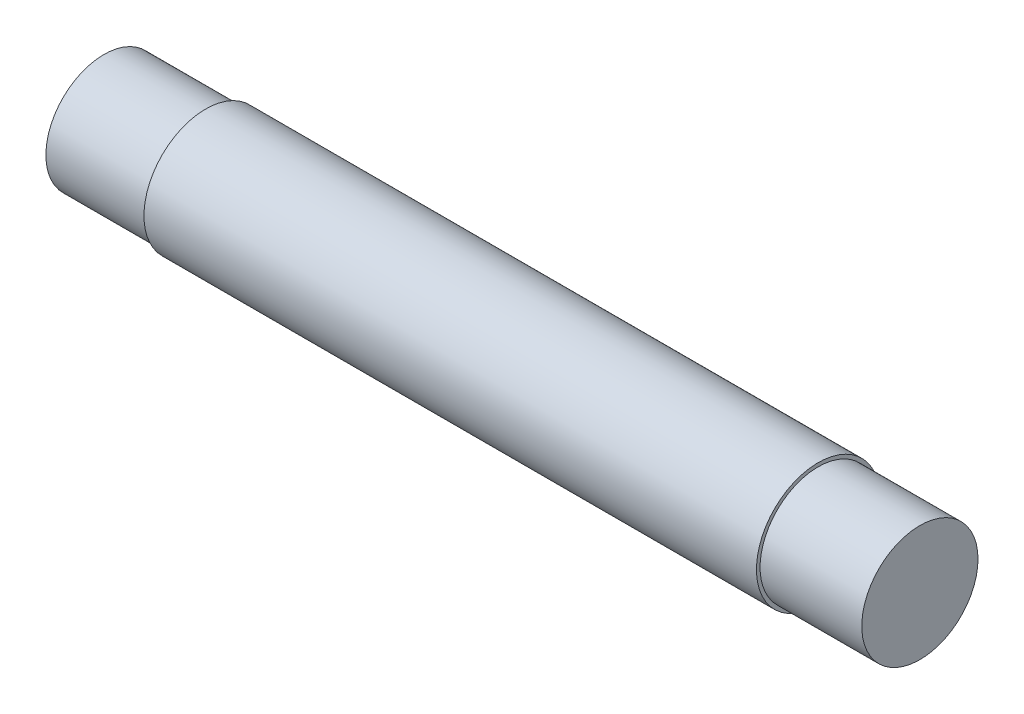
ISO-10303-21;
HEADER;
FILE_DESCRIPTION(('STEP AP214'),'2;1');
FILE_NAME('part.step','',(''),(''),'','','');
FILE_SCHEMA(('AUTOMOTIVE_DESIGN { 1 0 10303 214 1 1 1 1 }'));
ENDSEC;
DATA;
#1=APPLICATION_CONTEXT('core data for automotive mechanical design processes');
#2=APPLICATION_PROTOCOL_DEFINITION('international standard','automotive_design',2000,#1);
#3=PRODUCT_CONTEXT('',#1,'mechanical');
#4=PRODUCT('Part','Part','',(#3));
#5=PRODUCT_RELATED_PRODUCT_CATEGORY('part','',(#4));
#6=PRODUCT_DEFINITION_FORMATION('','',#4);
#7=PRODUCT_DEFINITION_CONTEXT('part definition',#1,'design');
#8=PRODUCT_DEFINITION('design','',#6,#7);
#9=PRODUCT_DEFINITION_SHAPE('','',#8);
#10=(LENGTH_UNIT() NAMED_UNIT(*) SI_UNIT(.MILLI.,.METRE.));
#11=(NAMED_UNIT(*) PLANE_ANGLE_UNIT() SI_UNIT($,.RADIAN.));
#12=(NAMED_UNIT(*) SI_UNIT($,.STERADIAN.) SOLID_ANGLE_UNIT());
#13=UNCERTAINTY_MEASURE_WITH_UNIT(LENGTH_MEASURE(1.E-05),#10,'distance_accuracy_value','');
#14=(GEOMETRIC_REPRESENTATION_CONTEXT(3) GLOBAL_UNCERTAINTY_ASSIGNED_CONTEXT((#13)) GLOBAL_UNIT_ASSIGNED_CONTEXT((#10,
#11,#12)) REPRESENTATION_CONTEXT('',''));
#15=CARTESIAN_POINT('',(0.,0.,0.));
#16=DIRECTION('',(0.,0.,1.));
#17=DIRECTION('',(1.,0.,0.));
#18=AXIS2_PLACEMENT_3D('',#15,#16,#17);
#19=CARTESIAN_POINT('',(-28.08,4.,0.));
#20=DIRECTION('',(-1.,0.,0.));
#21=DIRECTION('',(0.,0.,1.));
#22=AXIS2_PLACEMENT_3D('',#19,#20,#21);
#23=PLANE('',#22);
#24=CARTESIAN_POINT('',(-28.08,0.,0.));
#25=DIRECTION('',(1.,0.,0.));
#26=DIRECTION('',(0.,0.,-1.));
#27=AXIS2_PLACEMENT_3D('',#24,#25,#26);
#28=CIRCLE('',#27,4.);
#29=CARTESIAN_POINT('',(-28.08,0.,-4.));
#30=VERTEX_POINT('',#29);
#31=EDGE_CURVE('E17',#30,#30,#28,.T.);
#32=ORIENTED_EDGE('',*,*,#31,.F.);
#33=EDGE_LOOP('',(#32));
#34=FACE_BOUND('',#33,.T.);
#35=ADVANCED_FACE('F14',(#34),#23,.T.);
#36=CARTESIAN_POINT('',(28.08,4.,0.));
#37=DIRECTION('',(1.,0.,0.));
#38=DIRECTION('',(0.,0.,-1.));
#39=AXIS2_PLACEMENT_3D('',#36,#37,#38);
#40=PLANE('',#39);
#41=CARTESIAN_POINT('',(28.08,0.,0.));
#42=DIRECTION('',(1.,0.,0.));
#43=DIRECTION('',(0.,0.,-1.));
#44=AXIS2_PLACEMENT_3D('',#41,#42,#43);
#45=CIRCLE('',#44,4.);
#46=CARTESIAN_POINT('',(28.08,0.,-4.));
#47=VERTEX_POINT('',#46);
#48=EDGE_CURVE('E33',#47,#47,#45,.F.);
#49=ORIENTED_EDGE('',*,*,#48,.F.);
#50=EDGE_LOOP('',(#49));
#51=FACE_BOUND('',#50,.T.);
#52=ADVANCED_FACE('F44',(#51),#40,.T.);
#53=CARTESIAN_POINT('',(28.08,0.,0.));
#54=DIRECTION('',(1.,0.,0.));
#55=DIRECTION('',(0.,0.,-1.));
#56=AXIS2_PLACEMENT_3D('',#53,#54,#55);
#57=CYLINDRICAL_SURFACE('',#56,4.);
#58=ORIENTED_EDGE('',*,*,#31,.T.);
#59=EDGE_LOOP('',(#58));
#60=FACE_BOUND('',#59,.T.);
#61=CARTESIAN_POINT('',(-21.08,0.,0.));
#62=DIRECTION('',(1.,0.,0.));
#63=DIRECTION('',(0.,0.,-1.));
#64=AXIS2_PLACEMENT_3D('',#61,#62,#63);
#65=CIRCLE('',#64,4.);
#66=CARTESIAN_POINT('',(-21.08,0.,-4.));
#67=VERTEX_POINT('',#66);
#68=EDGE_CURVE('E31',#67,#67,#65,.T.);
#69=ORIENTED_EDGE('',*,*,#68,.F.);
#70=EDGE_LOOP('',(#69));
#71=FACE_BOUND('',#70,.T.);
#72=ADVANCED_FACE('F40',(#60,#71),#57,.T.);
#73=CARTESIAN_POINT('',(28.08,0.,0.));
#74=DIRECTION('',(1.,0.,0.));
#75=DIRECTION('',(0.,0.,-1.));
#76=AXIS2_PLACEMENT_3D('',#73,#74,#75);
#77=CYLINDRICAL_SURFACE('',#76,4.);
#78=CARTESIAN_POINT('',(21.08,0.,0.));
#79=DIRECTION('',(1.,0.,0.));
#80=DIRECTION('',(0.,0.,-1.));
#81=AXIS2_PLACEMENT_3D('',#78,#79,#80);
#82=CIRCLE('',#81,4.);
#83=CARTESIAN_POINT('',(21.08,0.,-4.));
#84=VERTEX_POINT('',#83);
#85=EDGE_CURVE('E26',#84,#84,#82,.F.);
#86=ORIENTED_EDGE('',*,*,#85,.F.);
#87=EDGE_LOOP('',(#86));
#88=FACE_BOUND('',#87,.T.);
#89=ORIENTED_EDGE('',*,*,#48,.T.);
#90=EDGE_LOOP('',(#89));
#91=FACE_BOUND('',#90,.T.);
#92=ADVANCED_FACE('F64',(#88,#91),#77,.T.);
#93=CARTESIAN_POINT('',(-21.08,4.25,0.));
#94=DIRECTION('',(-1.,0.,0.));
#95=DIRECTION('',(0.,0.,1.));
#96=AXIS2_PLACEMENT_3D('',#93,#94,#95);
#97=PLANE('',#96);
#98=CARTESIAN_POINT('',(-21.08,0.,0.));
#99=DIRECTION('',(1.,0.,0.));
#100=DIRECTION('',(0.,0.,-1.));
#101=AXIS2_PLACEMENT_3D('',#98,#99,#100);
#102=CIRCLE('',#101,4.25);
#103=CARTESIAN_POINT('',(-21.08,0.,-4.25));
#104=VERTEX_POINT('',#103);
#105=EDGE_CURVE('E21',#104,#104,#102,.T.);
#106=ORIENTED_EDGE('',*,*,#105,.F.);
#107=EDGE_LOOP('',(#106));
#108=FACE_BOUND('',#107,.T.);
#109=ORIENTED_EDGE('',*,*,#68,.T.);
#110=EDGE_LOOP('',(#109));
#111=FACE_BOUND('',#110,.T.);
#112=ADVANCED_FACE('F57',(#108,#111),#97,.T.);
#113=CARTESIAN_POINT('',(21.08,4.25,0.));
#114=DIRECTION('',(1.,0.,0.));
#115=DIRECTION('',(0.,0.,-1.));
#116=AXIS2_PLACEMENT_3D('',#113,#114,#115);
#117=PLANE('',#116);
#118=ORIENTED_EDGE('',*,*,#85,.T.);
#119=EDGE_LOOP('',(#118));
#120=FACE_BOUND('',#119,.T.);
#121=CARTESIAN_POINT('',(21.08,0.,0.));
#122=DIRECTION('',(1.,0.,0.));
#123=DIRECTION('',(0.,0.,-1.));
#124=AXIS2_PLACEMENT_3D('',#121,#122,#123);
#125=CIRCLE('',#124,4.25);
#126=CARTESIAN_POINT('',(21.08,0.,-4.25));
#127=VERTEX_POINT('',#126);
#128=EDGE_CURVE('E10',#127,#127,#125,.F.);
#129=ORIENTED_EDGE('',*,*,#128,.F.);
#130=EDGE_LOOP('',(#129));
#131=FACE_BOUND('',#130,.T.);
#132=ADVANCED_FACE('F52',(#120,#131),#117,.T.);
#133=CARTESIAN_POINT('',(28.08,0.,0.));
#134=DIRECTION('',(1.,0.,0.));
#135=DIRECTION('',(0.,0.,-1.));
#136=AXIS2_PLACEMENT_3D('',#133,#134,#135);
#137=CYLINDRICAL_SURFACE('',#136,4.25);
#138=ORIENTED_EDGE('',*,*,#128,.T.);
#139=EDGE_LOOP('',(#138));
#140=FACE_BOUND('',#139,.T.);
#141=ORIENTED_EDGE('',*,*,#105,.T.);
#142=EDGE_LOOP('',(#141));
#143=FACE_BOUND('',#142,.T.);
#144=ADVANCED_FACE('F50',(#140,#143),#137,.T.);
#145=CLOSED_SHELL('',(#35,#52,#72,#92,#112,#132,#144));
#146=MANIFOLD_SOLID_BREP('B1',#145);
#147=ADVANCED_BREP_SHAPE_REPRESENTATION('',(#18,#146),#14);
#148=SHAPE_DEFINITION_REPRESENTATION(#9,#147);
ENDSEC;
END-ISO-10303-21;
